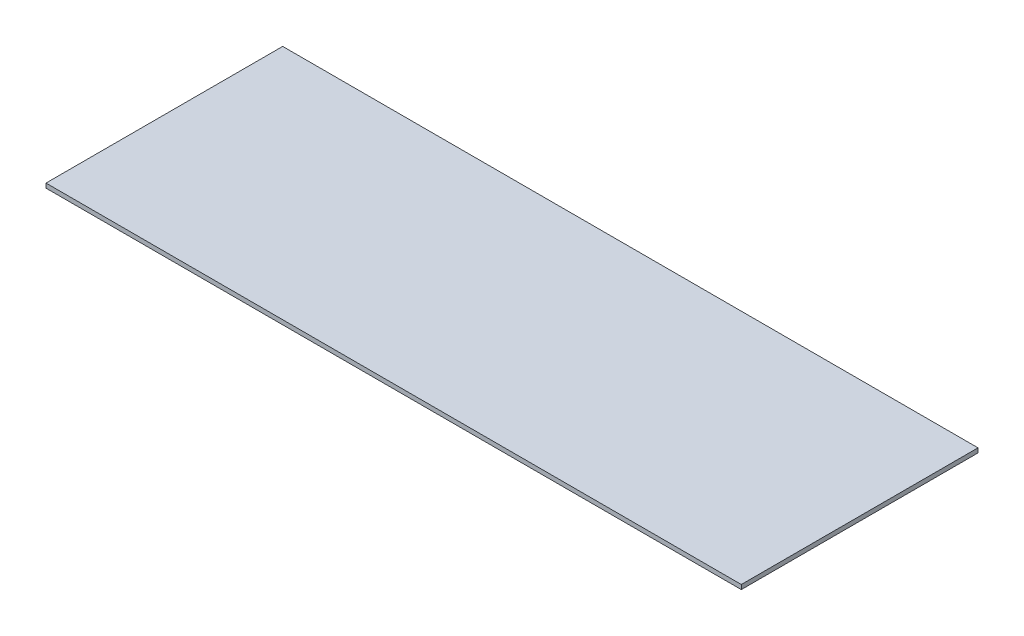
ISO-10303-21;
HEADER;
FILE_DESCRIPTION(('STEP AP214'),'2;1');
FILE_NAME('part.step','',(''),(''),'','','');
FILE_SCHEMA(('AUTOMOTIVE_DESIGN { 1 0 10303 214 1 1 1 1 }'));
ENDSEC;
DATA;
#1=APPLICATION_CONTEXT('core data for automotive mechanical design processes');
#2=APPLICATION_PROTOCOL_DEFINITION('international standard','automotive_design',2000,#1);
#3=PRODUCT_CONTEXT('',#1,'mechanical');
#4=PRODUCT('Part','Part','',(#3));
#5=PRODUCT_RELATED_PRODUCT_CATEGORY('part','',(#4));
#6=PRODUCT_DEFINITION_FORMATION('','',#4);
#7=PRODUCT_DEFINITION_CONTEXT('part definition',#1,'design');
#8=PRODUCT_DEFINITION('design','',#6,#7);
#9=PRODUCT_DEFINITION_SHAPE('','',#8);
#10=(LENGTH_UNIT() NAMED_UNIT(*) SI_UNIT(.MILLI.,.METRE.));
#11=(NAMED_UNIT(*) PLANE_ANGLE_UNIT() SI_UNIT($,.RADIAN.));
#12=(NAMED_UNIT(*) SI_UNIT($,.STERADIAN.) SOLID_ANGLE_UNIT());
#13=UNCERTAINTY_MEASURE_WITH_UNIT(LENGTH_MEASURE(1.E-05),#10,'distance_accuracy_value','');
#14=(GEOMETRIC_REPRESENTATION_CONTEXT(3) GLOBAL_UNCERTAINTY_ASSIGNED_CONTEXT((#13)) GLOBAL_UNIT_ASSIGNED_CONTEXT((#10,
#11,#12)) REPRESENTATION_CONTEXT('',''));
#15=CARTESIAN_POINT('',(0.,0.,0.));
#16=DIRECTION('',(0.,0.,1.));
#17=DIRECTION('',(1.,0.,0.));
#18=AXIS2_PLACEMENT_3D('',#15,#16,#17);
#19=CARTESIAN_POINT('',(235.,3.,80.));
#20=DIRECTION('',(-1.,0.,0.));
#21=DIRECTION('',(0.,0.,1.));
#22=AXIS2_PLACEMENT_3D('',#19,#20,#21);
#23=PLANE('',#22);
#24=DIRECTION('',(0.,0.,-1.));
#25=VECTOR('',#24,1.);
#26=CARTESIAN_POINT('',(235.,0.,80.));
#27=LINE('',#26,#25);
#28=CARTESIAN_POINT('',(235.,0.,80.));
#29=VERTEX_POINT('',#28);
#30=CARTESIAN_POINT('',(235.,0.,-80.));
#31=VERTEX_POINT('',#30);
#32=EDGE_CURVE('E97',#29,#31,#27,.T.);
#33=ORIENTED_EDGE('',*,*,#32,.T.);
#34=DIRECTION('',(0.,-1.,0.));
#35=VECTOR('',#34,1.);
#36=CARTESIAN_POINT('',(235.,3.,-80.));
#37=LINE('',#36,#35);
#38=CARTESIAN_POINT('',(235.,3.,-80.));
#39=VERTEX_POINT('',#38);
#40=EDGE_CURVE('E11',#39,#31,#37,.T.);
#41=ORIENTED_EDGE('',*,*,#40,.F.);
#42=DIRECTION('',(0.,0.,-1.));
#43=VECTOR('',#42,1.);
#44=CARTESIAN_POINT('',(235.,3.,80.));
#45=LINE('',#44,#43);
#46=CARTESIAN_POINT('',(235.,3.,80.));
#47=VERTEX_POINT('',#46);
#48=EDGE_CURVE('E85',#47,#39,#45,.T.);
#49=ORIENTED_EDGE('',*,*,#48,.F.);
#50=DIRECTION('',(0.,-1.,0.));
#51=VECTOR('',#50,1.);
#52=CARTESIAN_POINT('',(235.,3.,80.));
#53=LINE('',#52,#51);
#54=EDGE_CURVE('E93',#47,#29,#53,.T.);
#55=ORIENTED_EDGE('',*,*,#54,.T.);
#56=EDGE_LOOP('',(#33,#41,#49,#55));
#57=FACE_BOUND('',#56,.T.);
#58=ADVANCED_FACE('F34',(#57),#23,.F.);
#59=CARTESIAN_POINT('',(-235.,3.,-80.));
#60=DIRECTION('',(0.,0.,1.));
#61=DIRECTION('',(1.,0.,0.));
#62=AXIS2_PLACEMENT_3D('',#59,#60,#61);
#63=PLANE('',#62);
#64=DIRECTION('',(-1.,0.,0.));
#65=VECTOR('',#64,1.);
#66=CARTESIAN_POINT('',(-235.,0.,-80.));
#67=LINE('',#66,#65);
#68=CARTESIAN_POINT('',(-235.,0.,-80.));
#69=VERTEX_POINT('',#68);
#70=EDGE_CURVE('E89',#31,#69,#67,.T.);
#71=ORIENTED_EDGE('',*,*,#70,.T.);
#72=DIRECTION('',(0.,-1.,0.));
#73=VECTOR('',#72,1.);
#74=CARTESIAN_POINT('',(-235.,3.,-80.));
#75=LINE('',#74,#73);
#76=CARTESIAN_POINT('',(-235.,3.,-80.));
#77=VERTEX_POINT('',#76);
#78=EDGE_CURVE('E42',#77,#69,#75,.T.);
#79=ORIENTED_EDGE('',*,*,#78,.F.);
#80=DIRECTION('',(-1.,0.,0.));
#81=VECTOR('',#80,1.);
#82=CARTESIAN_POINT('',(-235.,3.,-80.));
#83=LINE('',#82,#81);
#84=EDGE_CURVE('E80',#39,#77,#83,.T.);
#85=ORIENTED_EDGE('',*,*,#84,.F.);
#86=ORIENTED_EDGE('',*,*,#40,.T.);
#87=EDGE_LOOP('',(#71,#79,#85,#86));
#88=FACE_BOUND('',#87,.T.);
#89=ADVANCED_FACE('F88',(#88),#63,.F.);
#90=CARTESIAN_POINT('',(-235.,3.,80.));
#91=DIRECTION('',(1.,0.,0.));
#92=DIRECTION('',(0.,0.,-1.));
#93=AXIS2_PLACEMENT_3D('',#90,#91,#92);
#94=PLANE('',#93);
#95=DIRECTION('',(0.,0.,1.));
#96=VECTOR('',#95,1.);
#97=CARTESIAN_POINT('',(-235.,0.,80.));
#98=LINE('',#97,#96);
#99=CARTESIAN_POINT('',(-235.,0.,80.));
#100=VERTEX_POINT('',#99);
#101=EDGE_CURVE('E67',#69,#100,#98,.T.);
#102=ORIENTED_EDGE('',*,*,#101,.T.);
#103=DIRECTION('',(0.,-1.,0.));
#104=VECTOR('',#103,1.);
#105=CARTESIAN_POINT('',(-235.,3.,80.));
#106=LINE('',#105,#104);
#107=CARTESIAN_POINT('',(-235.,3.,80.));
#108=VERTEX_POINT('',#107);
#109=EDGE_CURVE('E90',#108,#100,#106,.T.);
#110=ORIENTED_EDGE('',*,*,#109,.F.);
#111=DIRECTION('',(0.,0.,1.));
#112=VECTOR('',#111,1.);
#113=CARTESIAN_POINT('',(-235.,3.,80.));
#114=LINE('',#113,#112);
#115=EDGE_CURVE('E83',#77,#108,#114,.T.);
#116=ORIENTED_EDGE('',*,*,#115,.F.);
#117=ORIENTED_EDGE('',*,*,#78,.T.);
#118=EDGE_LOOP('',(#102,#110,#116,#117));
#119=FACE_BOUND('',#118,.T.);
#120=ADVANCED_FACE('F91',(#119),#94,.F.);
#121=CARTESIAN_POINT('',(-235.,3.,80.));
#122=DIRECTION('',(0.,0.,-1.));
#123=DIRECTION('',(-1.,0.,0.));
#124=AXIS2_PLACEMENT_3D('',#121,#122,#123);
#125=PLANE('',#124);
#126=DIRECTION('',(1.,0.,0.));
#127=VECTOR('',#126,1.);
#128=CARTESIAN_POINT('',(-235.,0.,80.));
#129=LINE('',#128,#127);
#130=EDGE_CURVE('E73',#100,#29,#129,.T.);
#131=ORIENTED_EDGE('',*,*,#130,.T.);
#132=ORIENTED_EDGE('',*,*,#54,.F.);
#133=DIRECTION('',(1.,0.,0.));
#134=VECTOR('',#133,1.);
#135=CARTESIAN_POINT('',(-235.,3.,80.));
#136=LINE('',#135,#134);
#137=EDGE_CURVE('E50',#108,#47,#136,.T.);
#138=ORIENTED_EDGE('',*,*,#137,.F.);
#139=ORIENTED_EDGE('',*,*,#109,.T.);
#140=EDGE_LOOP('',(#131,#132,#138,#139));
#141=FACE_BOUND('',#140,.T.);
#142=ADVANCED_FACE('F104',(#141),#125,.F.);
#143=CARTESIAN_POINT('',(0.,3.,0.));
#144=DIRECTION('',(0.,-1.,0.));
#145=DIRECTION('',(0.,0.,-1.));
#146=AXIS2_PLACEMENT_3D('',#143,#144,#145);
#147=PLANE('',#146);
#148=ORIENTED_EDGE('',*,*,#48,.T.);
#149=ORIENTED_EDGE('',*,*,#84,.T.);
#150=ORIENTED_EDGE('',*,*,#115,.T.);
#151=ORIENTED_EDGE('',*,*,#137,.T.);
#152=EDGE_LOOP('',(#148,#149,#150,#151));
#153=FACE_BOUND('',#152,.T.);
#154=ADVANCED_FACE('F81',(#153),#147,.F.);
#155=CARTESIAN_POINT('',(0.,0.,0.));
#156=DIRECTION('',(0.,-1.,0.));
#157=DIRECTION('',(0.,0.,-1.));
#158=AXIS2_PLACEMENT_3D('',#155,#156,#157);
#159=PLANE('',#158);
#160=ORIENTED_EDGE('',*,*,#32,.F.);
#161=ORIENTED_EDGE('',*,*,#130,.F.);
#162=ORIENTED_EDGE('',*,*,#101,.F.);
#163=ORIENTED_EDGE('',*,*,#70,.F.);
#164=EDGE_LOOP('',(#160,#161,#162,#163));
#165=FACE_BOUND('',#164,.T.);
#166=ADVANCED_FACE('F107',(#165),#159,.T.);
#167=CLOSED_SHELL('',(#58,#89,#120,#142,#154,#166));
#168=MANIFOLD_SOLID_BREP('B2',#167);
#169=ADVANCED_BREP_SHAPE_REPRESENTATION('',(#18,#168),#14);
#170=SHAPE_DEFINITION_REPRESENTATION(#9,#169);
ENDSEC;
END-ISO-10303-21;
